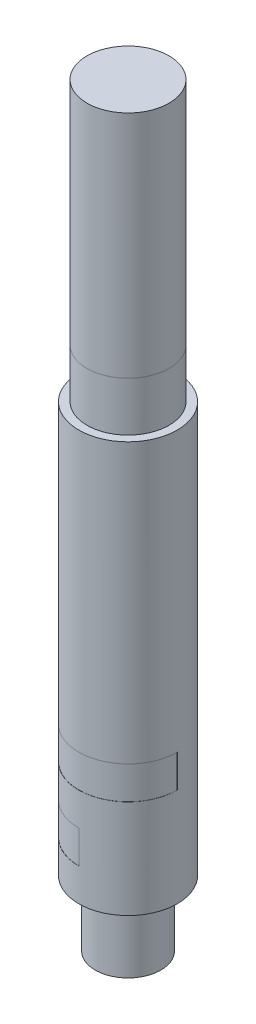
ISO-10303-21;
HEADER;
FILE_DESCRIPTION(('STEP AP214'),'2;1');
FILE_NAME('part.step','',(''),(''),'','','');
FILE_SCHEMA(('AUTOMOTIVE_DESIGN { 1 0 10303 214 1 1 1 1 }'));
ENDSEC;
DATA;
#1=APPLICATION_CONTEXT('core data for automotive mechanical design processes');
#2=APPLICATION_PROTOCOL_DEFINITION('international standard','automotive_design',2000,#1);
#3=PRODUCT_CONTEXT('',#1,'mechanical');
#4=PRODUCT('Part','Part','',(#3));
#5=PRODUCT_RELATED_PRODUCT_CATEGORY('part','',(#4));
#6=PRODUCT_DEFINITION_FORMATION('','',#4);
#7=PRODUCT_DEFINITION_CONTEXT('part definition',#1,'design');
#8=PRODUCT_DEFINITION('design','',#6,#7);
#9=PRODUCT_DEFINITION_SHAPE('','',#8);
#10=(LENGTH_UNIT() NAMED_UNIT(*) SI_UNIT(.MILLI.,.METRE.));
#11=(NAMED_UNIT(*) PLANE_ANGLE_UNIT() SI_UNIT($,.RADIAN.));
#12=(NAMED_UNIT(*) SI_UNIT($,.STERADIAN.) SOLID_ANGLE_UNIT());
#13=UNCERTAINTY_MEASURE_WITH_UNIT(LENGTH_MEASURE(1.E-05),#10,'distance_accuracy_value','');
#14=(GEOMETRIC_REPRESENTATION_CONTEXT(3) GLOBAL_UNCERTAINTY_ASSIGNED_CONTEXT((#13)) GLOBAL_UNIT_ASSIGNED_CONTEXT((#10,
#11,#12)) REPRESENTATION_CONTEXT('',''));
#15=CARTESIAN_POINT('',(0.,0.,0.));
#16=DIRECTION('',(0.,0.,1.));
#17=DIRECTION('',(1.,0.,0.));
#18=AXIS2_PLACEMENT_3D('',#15,#16,#17);
#19=CARTESIAN_POINT('',(0.,53.975,0.));
#20=DIRECTION('',(0.,-1.,0.));
#21=DIRECTION('',(0.,0.,-1.));
#22=AXIS2_PLACEMENT_3D('',#19,#20,#21);
#23=CYLINDRICAL_SURFACE('',#22,7.9375);
#24=CARTESIAN_POINT('',(0.,53.975,0.));
#25=DIRECTION('',(0.,1.,0.));
#26=DIRECTION('',(0.,0.,1.));
#27=AXIS2_PLACEMENT_3D('',#24,#25,#26);
#28=CIRCLE('',#27,7.9375);
#29=CARTESIAN_POINT('',(0.,53.975,7.9375));
#30=VERTEX_POINT('',#29);
#31=EDGE_CURVE('E46',#30,#30,#28,.T.);
#32=ORIENTED_EDGE('',*,*,#31,.F.);
#33=EDGE_LOOP('',(#32));
#34=FACE_BOUND('',#33,.T.);
#35=CARTESIAN_POINT('',(0.,9.525,0.));
#36=DIRECTION('',(0.,1.,0.));
#37=DIRECTION('',(0.,0.,1.));
#38=AXIS2_PLACEMENT_3D('',#35,#36,#37);
#39=CIRCLE('',#38,7.9375);
#40=CARTESIAN_POINT('',(0.,9.525,7.9375));
#41=VERTEX_POINT('',#40);
#42=EDGE_CURVE('E12',#41,#41,#39,.T.);
#43=ORIENTED_EDGE('',*,*,#42,.T.);
#44=EDGE_LOOP('',(#43));
#45=FACE_BOUND('',#44,.T.);
#46=ADVANCED_FACE('F38',(#34,#45),#23,.T.);
#47=CARTESIAN_POINT('',(0.,-79.375,0.));
#48=DIRECTION('',(0.,1.,0.));
#49=DIRECTION('',(0.,0.,1.));
#50=AXIS2_PLACEMENT_3D('',#47,#48,#49);
#51=CYLINDRICAL_SURFACE('',#50,9.525);
#52=CARTESIAN_POINT('',(0.,-66.675,0.));
#53=DIRECTION('',(0.,-1.,0.));
#54=DIRECTION('',(0.,0.,-1.));
#55=AXIS2_PLACEMENT_3D('',#52,#53,#54);
#56=CIRCLE('',#55,9.525);
#57=CARTESIAN_POINT('',(0.,-66.675,9.525));
#58=VERTEX_POINT('',#57);
#59=CARTESIAN_POINT('',(0.,-66.675,-9.525));
#60=VERTEX_POINT('',#59);
#61=EDGE_CURVE('E140',#58,#60,#56,.T.);
#62=ORIENTED_EDGE('',*,*,#61,.F.);
#63=DIRECTION('',(0.,-1.,0.));
#64=VECTOR('',#63,1.);
#65=CARTESIAN_POINT('',(0.,-66.675,9.525));
#66=LINE('',#65,#64);
#67=CARTESIAN_POINT('',(0.,-73.025,9.525));
#68=VERTEX_POINT('',#67);
#69=EDGE_CURVE('E162',#58,#68,#66,.T.);
#70=ORIENTED_EDGE('',*,*,#69,.T.);
#71=CARTESIAN_POINT('',(0.,-73.025,0.));
#72=DIRECTION('',(0.,-1.,0.));
#73=DIRECTION('',(0.,0.,-1.));
#74=AXIS2_PLACEMENT_3D('',#71,#72,#73);
#75=CIRCLE('',#74,9.525);
#76=CARTESIAN_POINT('',(0.,-73.025,-9.525));
#77=VERTEX_POINT('',#76);
#78=EDGE_CURVE('E153',#68,#77,#75,.T.);
#79=ORIENTED_EDGE('',*,*,#78,.T.);
#80=DIRECTION('',(0.,-1.,0.));
#81=VECTOR('',#80,1.);
#82=CARTESIAN_POINT('',(0.,-66.675,-9.525));
#83=LINE('',#82,#81);
#84=EDGE_CURVE('E160',#60,#77,#83,.T.);
#85=ORIENTED_EDGE('',*,*,#84,.F.);
#86=EDGE_LOOP('',(#62,#70,#79,#85));
#87=FACE_BOUND('',#86,.T.);
#88=CARTESIAN_POINT('',(0.,-79.375,0.));
#89=DIRECTION('',(0.,-1.,0.));
#90=DIRECTION('',(0.,0.,-1.));
#91=AXIS2_PLACEMENT_3D('',#88,#89,#90);
#92=CIRCLE('',#91,9.525);
#93=CARTESIAN_POINT('',(0.,-79.375,-9.525));
#94=VERTEX_POINT('',#93);
#95=EDGE_CURVE('E172',#94,#94,#92,.T.);
#96=ORIENTED_EDGE('',*,*,#95,.F.);
#97=EDGE_LOOP('',(#96));
#98=FACE_BOUND('',#97,.T.);
#99=CARTESIAN_POINT('',(0.,0.,0.));
#100=DIRECTION('',(0.,-1.,0.));
#101=DIRECTION('',(0.,0.,-1.));
#102=AXIS2_PLACEMENT_3D('',#99,#100,#101);
#103=CIRCLE('',#102,9.525);
#104=CARTESIAN_POINT('',(0.,0.,-9.525));
#105=VERTEX_POINT('',#104);
#106=EDGE_CURVE('E169',#105,#105,#103,.T.);
#107=ORIENTED_EDGE('',*,*,#106,.T.);
#108=EDGE_LOOP('',(#107));
#109=FACE_BOUND('',#108,.T.);
#110=CARTESIAN_POINT('',(0.,-53.975,0.));
#111=DIRECTION('',(0.,-1.,0.));
#112=DIRECTION('',(0.,0.,-1.));
#113=AXIS2_PLACEMENT_3D('',#110,#111,#112);
#114=CIRCLE('',#113,9.525);
#115=CARTESIAN_POINT('',(9.525,-53.975,0.));
#116=VERTEX_POINT('',#115);
#117=CARTESIAN_POINT('',(-9.525,-53.975,0.));
#118=VERTEX_POINT('',#117);
#119=EDGE_CURVE('E115',#116,#118,#114,.T.);
#120=ORIENTED_EDGE('',*,*,#119,.F.);
#121=DIRECTION('',(0.,-1.,0.));
#122=VECTOR('',#121,1.);
#123=CARTESIAN_POINT('',(9.525,-53.975,0.));
#124=LINE('',#123,#122);
#125=CARTESIAN_POINT('',(9.525,-60.325,0.));
#126=VERTEX_POINT('',#125);
#127=EDGE_CURVE('E150',#116,#126,#124,.T.);
#128=ORIENTED_EDGE('',*,*,#127,.T.);
#129=CARTESIAN_POINT('',(0.,-60.325,0.));
#130=DIRECTION('',(0.,-1.,0.));
#131=DIRECTION('',(0.,0.,-1.));
#132=AXIS2_PLACEMENT_3D('',#129,#130,#131);
#133=CIRCLE('',#132,9.525);
#134=CARTESIAN_POINT('',(-9.525,-60.325,0.));
#135=VERTEX_POINT('',#134);
#136=EDGE_CURVE('E127',#126,#135,#133,.T.);
#137=ORIENTED_EDGE('',*,*,#136,.T.);
#138=DIRECTION('',(0.,-1.,0.));
#139=VECTOR('',#138,1.);
#140=CARTESIAN_POINT('',(-9.525,-53.975,0.));
#141=LINE('',#140,#139);
#142=EDGE_CURVE('E108',#118,#135,#141,.T.);
#143=ORIENTED_EDGE('',*,*,#142,.F.);
#144=EDGE_LOOP('',(#120,#128,#137,#143));
#145=FACE_BOUND('',#144,.T.);
#146=ADVANCED_FACE('F126',(#87,#98,#109,#145),#51,.T.);
#147=CARTESIAN_POINT('',(0.,-79.375,0.));
#148=DIRECTION('',(0.,-1.,0.));
#149=DIRECTION('',(0.,0.,-1.));
#150=AXIS2_PLACEMENT_3D('',#147,#148,#149);
#151=PLANE('',#150);
#152=ORIENTED_EDGE('',*,*,#95,.T.);
#153=EDGE_LOOP('',(#152));
#154=FACE_BOUND('',#153,.T.);
#155=CARTESIAN_POINT('',(0.,-79.375,0.));
#156=DIRECTION('',(0.,-1.,0.));
#157=DIRECTION('',(0.,0.,-1.));
#158=AXIS2_PLACEMENT_3D('',#155,#156,#157);
#159=CIRCLE('',#158,6.35);
#160=CARTESIAN_POINT('',(0.,-79.375,-6.35));
#161=VERTEX_POINT('',#160);
#162=EDGE_CURVE('E159',#161,#161,#159,.T.);
#163=ORIENTED_EDGE('',*,*,#162,.F.);
#164=EDGE_LOOP('',(#163));
#165=FACE_BOUND('',#164,.T.);
#166=ADVANCED_FACE('F190',(#154,#165),#151,.T.);
#167=ORIENTED_EDGE('',*,*,#42,.F.);
#168=EDGE_LOOP('',(#167));
#169=FACE_BOUND('',#168,.T.);
#170=CARTESIAN_POINT('',(0.,0.,0.));
#171=DIRECTION('',(0.,-1.,0.));
#172=DIRECTION('',(0.,0.,-1.));
#173=AXIS2_PLACEMENT_3D('',#170,#171,#172);
#174=CIRCLE('',#173,7.9375);
#175=CARTESIAN_POINT('',(0.,0.,-7.9375));
#176=VERTEX_POINT('',#175);
#177=EDGE_CURVE('E175',#176,#176,#174,.T.);
#178=ORIENTED_EDGE('',*,*,#177,.F.);
#179=EDGE_LOOP('',(#178));
#180=FACE_BOUND('',#179,.T.);
#181=ADVANCED_FACE('F40',(#169,#180),#23,.T.);
#182=CARTESIAN_POINT('',(0.,53.975,0.));
#183=DIRECTION('',(0.,1.,0.));
#184=DIRECTION('',(0.,0.,1.));
#185=AXIS2_PLACEMENT_3D('',#182,#183,#184);
#186=PLANE('',#185);
#187=ORIENTED_EDGE('',*,*,#31,.T.);
#188=EDGE_LOOP('',(#187));
#189=FACE_BOUND('',#188,.T.);
#190=ADVANCED_FACE('F182',(#189),#186,.T.);
#191=CARTESIAN_POINT('',(0.,0.,0.));
#192=DIRECTION('',(0.,-1.,0.));
#193=DIRECTION('',(0.,0.,-1.));
#194=AXIS2_PLACEMENT_3D('',#191,#192,#193);
#195=PLANE('',#194);
#196=ORIENTED_EDGE('',*,*,#106,.F.);
#197=EDGE_LOOP('',(#196));
#198=FACE_BOUND('',#197,.T.);
#199=ORIENTED_EDGE('',*,*,#177,.T.);
#200=EDGE_LOOP('',(#199));
#201=FACE_BOUND('',#200,.T.);
#202=ADVANCED_FACE('F193',(#198,#201),#195,.F.);
#203=CARTESIAN_POINT('',(0.,-92.075,0.));
#204=DIRECTION('',(0.,1.,0.));
#205=DIRECTION('',(0.,0.,1.));
#206=AXIS2_PLACEMENT_3D('',#203,#204,#205);
#207=CYLINDRICAL_SURFACE('',#206,6.35);
#208=CARTESIAN_POINT('',(0.,-92.075,0.));
#209=DIRECTION('',(0.,-1.,0.));
#210=DIRECTION('',(0.,0.,-1.));
#211=AXIS2_PLACEMENT_3D('',#208,#209,#210);
#212=CIRCLE('',#211,6.35);
#213=CARTESIAN_POINT('',(0.,-92.075,-6.35));
#214=VERTEX_POINT('',#213);
#215=EDGE_CURVE('E166',#214,#214,#212,.T.);
#216=ORIENTED_EDGE('',*,*,#215,.F.);
#217=EDGE_LOOP('',(#216));
#218=FACE_BOUND('',#217,.T.);
#219=ORIENTED_EDGE('',*,*,#162,.T.);
#220=EDGE_LOOP('',(#219));
#221=FACE_BOUND('',#220,.T.);
#222=ADVANCED_FACE('F195',(#218,#221),#207,.T.);
#223=CARTESIAN_POINT('',(0.,-92.075,0.));
#224=DIRECTION('',(0.,-1.,0.));
#225=DIRECTION('',(0.,0.,-1.));
#226=AXIS2_PLACEMENT_3D('',#223,#224,#225);
#227=PLANE('',#226);
#228=ORIENTED_EDGE('',*,*,#215,.T.);
#229=EDGE_LOOP('',(#228));
#230=FACE_BOUND('',#229,.T.);
#231=ADVANCED_FACE('F202',(#230),#227,.T.);
#232=CARTESIAN_POINT('',(0.,-66.675,0.));
#233=DIRECTION('',(0.,-1.,0.));
#234=DIRECTION('',(0.,0.,-1.));
#235=AXIS2_PLACEMENT_3D('',#232,#233,#234);
#236=CYLINDRICAL_SURFACE('',#235,9.4996);
#237=CARTESIAN_POINT('',(0.,-73.025,0.));
#238=DIRECTION('',(0.,1.,0.));
#239=DIRECTION('',(0.,0.,-1.));
#240=AXIS2_PLACEMENT_3D('',#237,#238,#239);
#241=CIRCLE('',#240,9.4996);
#242=CARTESIAN_POINT('',(0.,-73.025,-9.4996));
#243=VERTEX_POINT('',#242);
#244=CARTESIAN_POINT('',(0.,-73.025,9.4996));
#245=VERTEX_POINT('',#244);
#246=EDGE_CURVE('E146',#243,#245,#241,.T.);
#247=ORIENTED_EDGE('',*,*,#246,.T.);
#248=DIRECTION('',(0.,-1.,0.));
#249=VECTOR('',#248,1.);
#250=CARTESIAN_POINT('',(0.,-66.675,9.4996));
#251=LINE('',#250,#249);
#252=CARTESIAN_POINT('',(0.,-66.675,9.4996));
#253=VERTEX_POINT('',#252);
#254=EDGE_CURVE('E145',#253,#245,#251,.T.);
#255=ORIENTED_EDGE('',*,*,#254,.F.);
#256=CARTESIAN_POINT('',(0.,-66.675,0.));
#257=DIRECTION('',(0.,1.,0.));
#258=DIRECTION('',(0.,0.,-1.));
#259=AXIS2_PLACEMENT_3D('',#256,#257,#258);
#260=CIRCLE('',#259,9.4996);
#261=CARTESIAN_POINT('',(0.,-66.675,-9.4996));
#262=VERTEX_POINT('',#261);
#263=EDGE_CURVE('E134',#262,#253,#260,.T.);
#264=ORIENTED_EDGE('',*,*,#263,.F.);
#265=DIRECTION('',(0.,-1.,0.));
#266=VECTOR('',#265,1.);
#267=CARTESIAN_POINT('',(0.,-66.675,-9.4996));
#268=LINE('',#267,#266);
#269=EDGE_CURVE('E157',#262,#243,#268,.T.);
#270=ORIENTED_EDGE('',*,*,#269,.T.);
#271=EDGE_LOOP('',(#247,#255,#264,#270));
#272=FACE_BOUND('',#271,.T.);
#273=ADVANCED_FACE('F230',(#272),#236,.T.);
#274=CARTESIAN_POINT('',(0.,-66.675,-9.525));
#275=DIRECTION('',(1.,0.,0.));
#276=DIRECTION('',(0.,0.,-1.));
#277=AXIS2_PLACEMENT_3D('',#274,#275,#276);
#278=PLANE('',#277);
#279=DIRECTION('',(0.,0.,1.));
#280=VECTOR('',#279,1.);
#281=CARTESIAN_POINT('',(0.,-73.025,-9.525));
#282=LINE('',#281,#280);
#283=EDGE_CURVE('E61',#77,#243,#282,.T.);
#284=ORIENTED_EDGE('',*,*,#283,.T.);
#285=ORIENTED_EDGE('',*,*,#269,.F.);
#286=DIRECTION('',(0.,0.,1.));
#287=VECTOR('',#286,1.);
#288=CARTESIAN_POINT('',(0.,-66.675,-9.525));
#289=LINE('',#288,#287);
#290=EDGE_CURVE('E142',#60,#262,#289,.T.);
#291=ORIENTED_EDGE('',*,*,#290,.F.);
#292=ORIENTED_EDGE('',*,*,#84,.T.);
#293=EDGE_LOOP('',(#284,#285,#291,#292));
#294=FACE_BOUND('',#293,.T.);
#295=ADVANCED_FACE('F227',(#294),#278,.F.);
#296=CARTESIAN_POINT('',(0.,-66.675,9.4996));
#297=DIRECTION('',(1.,0.,0.));
#298=DIRECTION('',(0.,0.,-1.));
#299=AXIS2_PLACEMENT_3D('',#296,#297,#298);
#300=PLANE('',#299);
#301=DIRECTION('',(0.,0.,1.));
#302=VECTOR('',#301,1.);
#303=CARTESIAN_POINT('',(0.,-73.025,9.4996));
#304=LINE('',#303,#302);
#305=EDGE_CURVE('E149',#245,#68,#304,.T.);
#306=ORIENTED_EDGE('',*,*,#305,.T.);
#307=ORIENTED_EDGE('',*,*,#69,.F.);
#308=DIRECTION('',(0.,0.,1.));
#309=VECTOR('',#308,1.);
#310=CARTESIAN_POINT('',(0.,-66.675,9.4996));
#311=LINE('',#310,#309);
#312=EDGE_CURVE('E137',#253,#58,#311,.T.);
#313=ORIENTED_EDGE('',*,*,#312,.F.);
#314=ORIENTED_EDGE('',*,*,#254,.T.);
#315=EDGE_LOOP('',(#306,#307,#313,#314));
#316=FACE_BOUND('',#315,.T.);
#317=ADVANCED_FACE('F233',(#316),#300,.F.);
#318=CARTESIAN_POINT('',(0.,-66.675,0.));
#319=DIRECTION('',(0.,-1.,0.));
#320=DIRECTION('',(0.,0.,-1.));
#321=AXIS2_PLACEMENT_3D('',#318,#319,#320);
#322=PLANE('',#321);
#323=ORIENTED_EDGE('',*,*,#263,.T.);
#324=ORIENTED_EDGE('',*,*,#312,.T.);
#325=ORIENTED_EDGE('',*,*,#61,.T.);
#326=ORIENTED_EDGE('',*,*,#290,.T.);
#327=EDGE_LOOP('',(#323,#324,#325,#326));
#328=FACE_BOUND('',#327,.T.);
#329=ADVANCED_FACE('F224',(#328),#322,.T.);
#330=CARTESIAN_POINT('',(0.,-73.025,0.));
#331=DIRECTION('',(0.,-1.,0.));
#332=DIRECTION('',(0.,0.,-1.));
#333=AXIS2_PLACEMENT_3D('',#330,#331,#332);
#334=PLANE('',#333);
#335=ORIENTED_EDGE('',*,*,#246,.F.);
#336=ORIENTED_EDGE('',*,*,#283,.F.);
#337=ORIENTED_EDGE('',*,*,#78,.F.);
#338=ORIENTED_EDGE('',*,*,#305,.F.);
#339=EDGE_LOOP('',(#335,#336,#337,#338));
#340=FACE_BOUND('',#339,.T.);
#341=ADVANCED_FACE('F234',(#340),#334,.F.);
#342=CARTESIAN_POINT('',(9.4996,-53.975,0.));
#343=DIRECTION('',(0.,0.,-1.));
#344=DIRECTION('',(-1.,0.,0.));
#345=AXIS2_PLACEMENT_3D('',#342,#343,#344);
#346=PLANE('',#345);
#347=DIRECTION('',(1.,0.,0.));
#348=VECTOR('',#347,1.);
#349=CARTESIAN_POINT('',(9.4996,-60.325,0.));
#350=LINE('',#349,#348);
#351=CARTESIAN_POINT('',(9.4996,-60.325,0.));
#352=VERTEX_POINT('',#351);
#353=EDGE_CURVE('E124',#352,#126,#350,.T.);
#354=ORIENTED_EDGE('',*,*,#353,.T.);
#355=ORIENTED_EDGE('',*,*,#127,.F.);
#356=DIRECTION('',(1.,0.,0.));
#357=VECTOR('',#356,1.);
#358=CARTESIAN_POINT('',(9.4996,-53.975,0.));
#359=LINE('',#358,#357);
#360=CARTESIAN_POINT('',(9.4996,-53.975,0.));
#361=VERTEX_POINT('',#360);
#362=EDGE_CURVE('E121',#361,#116,#359,.T.);
#363=ORIENTED_EDGE('',*,*,#362,.F.);
#364=DIRECTION('',(0.,-1.,0.));
#365=VECTOR('',#364,1.);
#366=CARTESIAN_POINT('',(9.4996,-53.975,0.));
#367=LINE('',#366,#365);
#368=EDGE_CURVE('E129',#361,#352,#367,.T.);
#369=ORIENTED_EDGE('',*,*,#368,.T.);
#370=EDGE_LOOP('',(#354,#355,#363,#369));
#371=FACE_BOUND('',#370,.T.);
#372=ADVANCED_FACE('F236',(#371),#346,.F.);
#373=CARTESIAN_POINT('',(0.,-53.975,0.));
#374=DIRECTION('',(0.,-1.,0.));
#375=DIRECTION('',(0.,0.,-1.));
#376=AXIS2_PLACEMENT_3D('',#373,#374,#375);
#377=CYLINDRICAL_SURFACE('',#376,9.4996);
#378=CARTESIAN_POINT('',(0.,-60.325,0.));
#379=DIRECTION('',(0.,1.,0.));
#380=DIRECTION('',(0.,0.,-1.));
#381=AXIS2_PLACEMENT_3D('',#378,#379,#380);
#382=CIRCLE('',#381,9.4996);
#383=CARTESIAN_POINT('',(-9.4996,-60.325,0.));
#384=VERTEX_POINT('',#383);
#385=EDGE_CURVE('E376',#384,#352,#382,.T.);
#386=ORIENTED_EDGE('',*,*,#385,.T.);
#387=ORIENTED_EDGE('',*,*,#368,.F.);
#388=CARTESIAN_POINT('',(0.,-53.975,0.));
#389=DIRECTION('',(0.,1.,0.));
#390=DIRECTION('',(0.,0.,-1.));
#391=AXIS2_PLACEMENT_3D('',#388,#389,#390);
#392=CIRCLE('',#391,9.4996);
#393=CARTESIAN_POINT('',(-9.4996,-53.975,0.));
#394=VERTEX_POINT('',#393);
#395=EDGE_CURVE('E114',#394,#361,#392,.T.);
#396=ORIENTED_EDGE('',*,*,#395,.F.);
#397=DIRECTION('',(0.,-1.,0.));
#398=VECTOR('',#397,1.);
#399=CARTESIAN_POINT('',(-9.4996,-53.975,0.));
#400=LINE('',#399,#398);
#401=EDGE_CURVE('E110',#394,#384,#400,.T.);
#402=ORIENTED_EDGE('',*,*,#401,.T.);
#403=EDGE_LOOP('',(#386,#387,#396,#402));
#404=FACE_BOUND('',#403,.T.);
#405=ADVANCED_FACE('F242',(#404),#377,.T.);
#406=CARTESIAN_POINT('',(-9.525,-53.975,0.));
#407=DIRECTION('',(0.,0.,-1.));
#408=DIRECTION('',(-1.,0.,0.));
#409=AXIS2_PLACEMENT_3D('',#406,#407,#408);
#410=PLANE('',#409);
#411=DIRECTION('',(1.,0.,0.));
#412=VECTOR('',#411,1.);
#413=CARTESIAN_POINT('',(-9.525,-60.325,0.));
#414=LINE('',#413,#412);
#415=EDGE_CURVE('E53',#135,#384,#414,.T.);
#416=ORIENTED_EDGE('',*,*,#415,.T.);
#417=ORIENTED_EDGE('',*,*,#401,.F.);
#418=DIRECTION('',(1.,0.,0.));
#419=VECTOR('',#418,1.);
#420=CARTESIAN_POINT('',(-9.525,-53.975,0.));
#421=LINE('',#420,#419);
#422=EDGE_CURVE('E104',#118,#394,#421,.T.);
#423=ORIENTED_EDGE('',*,*,#422,.F.);
#424=ORIENTED_EDGE('',*,*,#142,.T.);
#425=EDGE_LOOP('',(#416,#417,#423,#424));
#426=FACE_BOUND('',#425,.T.);
#427=ADVANCED_FACE('F106',(#426),#410,.F.);
#428=CARTESIAN_POINT('',(0.,-53.975,0.));
#429=DIRECTION('',(0.,-1.,0.));
#430=DIRECTION('',(0.,0.,-1.));
#431=AXIS2_PLACEMENT_3D('',#428,#429,#430);
#432=PLANE('',#431);
#433=ORIENTED_EDGE('',*,*,#119,.T.);
#434=ORIENTED_EDGE('',*,*,#422,.T.);
#435=ORIENTED_EDGE('',*,*,#395,.T.);
#436=ORIENTED_EDGE('',*,*,#362,.T.);
#437=EDGE_LOOP('',(#433,#434,#435,#436));
#438=FACE_BOUND('',#437,.T.);
#439=ADVANCED_FACE('F119',(#438),#432,.T.);
#440=CARTESIAN_POINT('',(0.,-60.325,0.));
#441=DIRECTION('',(0.,-1.,0.));
#442=DIRECTION('',(0.,0.,-1.));
#443=AXIS2_PLACEMENT_3D('',#440,#441,#442);
#444=PLANE('',#443);
#445=ORIENTED_EDGE('',*,*,#136,.F.);
#446=ORIENTED_EDGE('',*,*,#353,.F.);
#447=ORIENTED_EDGE('',*,*,#385,.F.);
#448=ORIENTED_EDGE('',*,*,#415,.F.);
#449=EDGE_LOOP('',(#445,#446,#447,#448));
#450=FACE_BOUND('',#449,.T.);
#451=ADVANCED_FACE('F318',(#450),#444,.F.);
#452=CLOSED_SHELL('',(#46,#146,#166,#181,#190,#202,#222,#231,#273,#295,#317,#329,#341,#372,#405,
#427,#439,#451));
#453=MANIFOLD_SOLID_BREP('B2',#452);
#454=ADVANCED_BREP_SHAPE_REPRESENTATION('',(#18,#453),#14);
#455=SHAPE_DEFINITION_REPRESENTATION(#9,#454);
ENDSEC;
END-ISO-10303-21;
